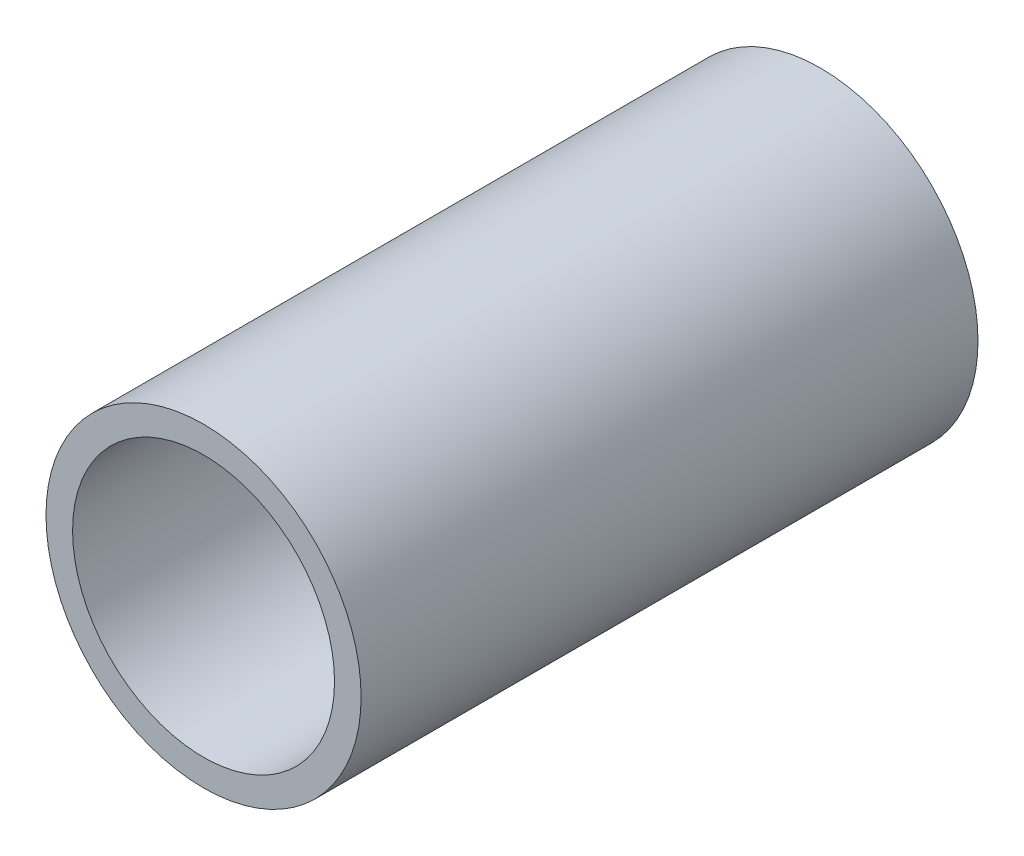
ISO-10303-21;
HEADER;
FILE_DESCRIPTION(('STEP AP214'),'2;1');
FILE_NAME('part.step','',(''),(''),'','','');
FILE_SCHEMA(('AUTOMOTIVE_DESIGN { 1 0 10303 214 1 1 1 1 }'));
ENDSEC;
DATA;
#1=APPLICATION_CONTEXT('core data for automotive mechanical design processes');
#2=APPLICATION_PROTOCOL_DEFINITION('international standard','automotive_design',2000,#1);
#3=PRODUCT_CONTEXT('',#1,'mechanical');
#4=PRODUCT('Part','Part','',(#3));
#5=PRODUCT_RELATED_PRODUCT_CATEGORY('part','',(#4));
#6=PRODUCT_DEFINITION_FORMATION('','',#4);
#7=PRODUCT_DEFINITION_CONTEXT('part definition',#1,'design');
#8=PRODUCT_DEFINITION('design','',#6,#7);
#9=PRODUCT_DEFINITION_SHAPE('','',#8);
#10=(LENGTH_UNIT() NAMED_UNIT(*) SI_UNIT(.MILLI.,.METRE.));
#11=(NAMED_UNIT(*) PLANE_ANGLE_UNIT() SI_UNIT($,.RADIAN.));
#12=(NAMED_UNIT(*) SI_UNIT($,.STERADIAN.) SOLID_ANGLE_UNIT());
#13=UNCERTAINTY_MEASURE_WITH_UNIT(LENGTH_MEASURE(1.E-05),#10,'distance_accuracy_value','');
#14=(GEOMETRIC_REPRESENTATION_CONTEXT(3) GLOBAL_UNCERTAINTY_ASSIGNED_CONTEXT((#13)) GLOBAL_UNIT_ASSIGNED_CONTEXT((#10,
#11,#12)) REPRESENTATION_CONTEXT('',''));
#15=CARTESIAN_POINT('',(0.,0.,0.));
#16=DIRECTION('',(0.,0.,1.));
#17=DIRECTION('',(1.,0.,0.));
#18=AXIS2_PLACEMENT_3D('',#15,#16,#17);
#19=CARTESIAN_POINT('',(0.,0.,41.275));
#20=DIRECTION('',(0.,0.,1.));
#21=DIRECTION('',(1.,0.,0.));
#22=AXIS2_PLACEMENT_3D('',#19,#20,#21);
#23=PLANE('',#22);
#24=CARTESIAN_POINT('',(0.,0.,41.275));
#25=DIRECTION('',(0.,0.,1.));
#26=DIRECTION('',(1.,0.,0.));
#27=AXIS2_PLACEMENT_3D('',#24,#25,#26);
#28=CIRCLE('',#27,21.082);
#29=CARTESIAN_POINT('',(21.082,0.,41.275));
#30=VERTEX_POINT('',#29);
#31=EDGE_CURVE('E11',#30,#30,#28,.T.);
#32=ORIENTED_EDGE('',*,*,#31,.T.);
#33=EDGE_LOOP('',(#32));
#34=FACE_BOUND('',#33,.T.);
#35=CARTESIAN_POINT('',(0.,0.,41.275));
#36=DIRECTION('',(0.,0.,1.));
#37=DIRECTION('',(1.,0.,0.));
#38=AXIS2_PLACEMENT_3D('',#35,#36,#37);
#39=CIRCLE('',#38,17.526);
#40=CARTESIAN_POINT('',(17.526,0.,41.275));
#41=VERTEX_POINT('',#40);
#42=EDGE_CURVE('E56',#41,#41,#39,.T.);
#43=ORIENTED_EDGE('',*,*,#42,.F.);
#44=EDGE_LOOP('',(#43));
#45=FACE_BOUND('',#44,.T.);
#46=ADVANCED_FACE('F43',(#34,#45),#23,.T.);
#47=CARTESIAN_POINT('',(0.,0.,-41.275));
#48=DIRECTION('',(0.,0.,1.));
#49=DIRECTION('',(1.,0.,0.));
#50=AXIS2_PLACEMENT_3D('',#47,#48,#49);
#51=PLANE('',#50);
#52=CARTESIAN_POINT('',(0.,0.,-41.275));
#53=DIRECTION('',(0.,0.,1.));
#54=DIRECTION('',(1.,0.,0.));
#55=AXIS2_PLACEMENT_3D('',#52,#53,#54);
#56=CIRCLE('',#55,21.082);
#57=CARTESIAN_POINT('',(21.082,0.,-41.275));
#58=VERTEX_POINT('',#57);
#59=EDGE_CURVE('E47',#58,#58,#56,.T.);
#60=ORIENTED_EDGE('',*,*,#59,.F.);
#61=EDGE_LOOP('',(#60));
#62=FACE_BOUND('',#61,.T.);
#63=CARTESIAN_POINT('',(0.,0.,-41.275));
#64=DIRECTION('',(0.,0.,1.));
#65=DIRECTION('',(1.,0.,0.));
#66=AXIS2_PLACEMENT_3D('',#63,#64,#65);
#67=CIRCLE('',#66,17.526);
#68=CARTESIAN_POINT('',(17.526,0.,-41.275));
#69=VERTEX_POINT('',#68);
#70=EDGE_CURVE('E58',#69,#69,#67,.T.);
#71=ORIENTED_EDGE('',*,*,#70,.T.);
#72=EDGE_LOOP('',(#71));
#73=FACE_BOUND('',#72,.T.);
#74=ADVANCED_FACE('F70',(#62,#73),#51,.F.);
#75=CARTESIAN_POINT('',(0.,0.,41.275));
#76=DIRECTION('',(0.,0.,-1.));
#77=DIRECTION('',(-1.,0.,0.));
#78=AXIS2_PLACEMENT_3D('',#75,#76,#77);
#79=CYLINDRICAL_SURFACE('',#78,21.082);
#80=ORIENTED_EDGE('',*,*,#31,.F.);
#81=EDGE_LOOP('',(#80));
#82=FACE_BOUND('',#81,.T.);
#83=ORIENTED_EDGE('',*,*,#59,.T.);
#84=EDGE_LOOP('',(#83));
#85=FACE_BOUND('',#84,.T.);
#86=ADVANCED_FACE('F45',(#82,#85),#79,.T.);
#87=CARTESIAN_POINT('',(0.,0.,41.275));
#88=DIRECTION('',(0.,0.,-1.));
#89=DIRECTION('',(-1.,0.,0.));
#90=AXIS2_PLACEMENT_3D('',#87,#88,#89);
#91=CYLINDRICAL_SURFACE('',#90,17.526);
#92=ORIENTED_EDGE('',*,*,#42,.T.);
#93=EDGE_LOOP('',(#92));
#94=FACE_BOUND('',#93,.T.);
#95=ORIENTED_EDGE('',*,*,#70,.F.);
#96=EDGE_LOOP('',(#95));
#97=FACE_BOUND('',#96,.T.);
#98=ADVANCED_FACE('F66',(#94,#97),#91,.F.);
#99=CLOSED_SHELL('',(#46,#74,#86,#98));
#100=MANIFOLD_SOLID_BREP('B2',#99);
#101=ADVANCED_BREP_SHAPE_REPRESENTATION('',(#18,#100),#14);
#102=SHAPE_DEFINITION_REPRESENTATION(#9,#101);
ENDSEC;
END-ISO-10303-21;
